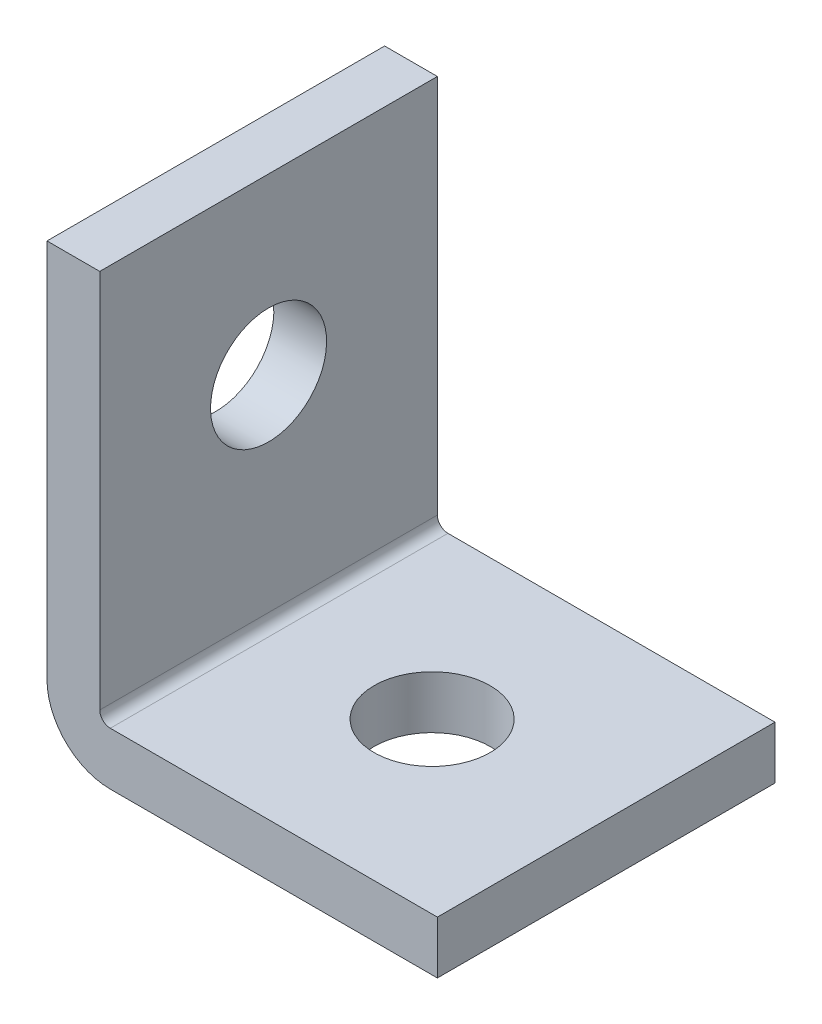
ISO-10303-21;
HEADER;
FILE_DESCRIPTION(('STEP AP214'),'2;1');
FILE_NAME('part.step','',(''),(''),'','','');
FILE_SCHEMA(('AUTOMOTIVE_DESIGN { 1 0 10303 214 1 1 1 1 }'));
ENDSEC;
DATA;
#1=APPLICATION_CONTEXT('core data for automotive mechanical design processes');
#2=APPLICATION_PROTOCOL_DEFINITION('international standard','automotive_design',2000,#1);
#3=PRODUCT_CONTEXT('',#1,'mechanical');
#4=PRODUCT('Part','Part','',(#3));
#5=PRODUCT_RELATED_PRODUCT_CATEGORY('part','',(#4));
#6=PRODUCT_DEFINITION_FORMATION('','',#4);
#7=PRODUCT_DEFINITION_CONTEXT('part definition',#1,'design');
#8=PRODUCT_DEFINITION('design','',#6,#7);
#9=PRODUCT_DEFINITION_SHAPE('','',#8);
#10=(LENGTH_UNIT() NAMED_UNIT(*) SI_UNIT(.MILLI.,.METRE.));
#11=(NAMED_UNIT(*) PLANE_ANGLE_UNIT() SI_UNIT($,.RADIAN.));
#12=(NAMED_UNIT(*) SI_UNIT($,.STERADIAN.) SOLID_ANGLE_UNIT());
#13=UNCERTAINTY_MEASURE_WITH_UNIT(LENGTH_MEASURE(1.E-05),#10,'distance_accuracy_value','');
#14=(GEOMETRIC_REPRESENTATION_CONTEXT(3) GLOBAL_UNCERTAINTY_ASSIGNED_CONTEXT((#13)) GLOBAL_UNIT_ASSIGNED_CONTEXT((#10,
#11,#12)) REPRESENTATION_CONTEXT('',''));
#15=CARTESIAN_POINT('',(0.,0.,0.));
#16=DIRECTION('',(0.,0.,1.));
#17=DIRECTION('',(1.,0.,0.));
#18=AXIS2_PLACEMENT_3D('',#15,#16,#17);
#19=CARTESIAN_POINT('',(0.,46.99,20.32));
#20=DIRECTION('',(0.,-1.,0.));
#21=DIRECTION('',(0.,0.,-1.));
#22=AXIS2_PLACEMENT_3D('',#19,#20,#21);
#23=PLANE('',#22);
#24=DIRECTION('',(-1.,0.,0.));
#25=VECTOR('',#24,1.);
#26=CARTESIAN_POINT('',(0.,46.99,-20.32));
#27=LINE('',#26,#25);
#28=CARTESIAN_POINT('',(0.,46.99,-20.32));
#29=VERTEX_POINT('',#28);
#30=CARTESIAN_POINT('',(-6.35000000000001,46.99,-20.32));
#31=VERTEX_POINT('',#30);
#32=EDGE_CURVE('E128',#29,#31,#27,.T.);
#33=ORIENTED_EDGE('',*,*,#32,.T.);
#34=DIRECTION('',(0.,0.,-1.));
#35=VECTOR('',#34,1.);
#36=CARTESIAN_POINT('',(-6.35000000000001,46.99,20.32));
#37=LINE('',#36,#35);
#38=CARTESIAN_POINT('',(-6.35000000000001,46.99,20.32));
#39=VERTEX_POINT('',#38);
#40=EDGE_CURVE('E11',#39,#31,#37,.T.);
#41=ORIENTED_EDGE('',*,*,#40,.F.);
#42=DIRECTION('',(-1.,0.,0.));
#43=VECTOR('',#42,1.);
#44=CARTESIAN_POINT('',(0.,46.99,20.32));
#45=LINE('',#44,#43);
#46=CARTESIAN_POINT('',(0.,46.99,20.32));
#47=VERTEX_POINT('',#46);
#48=EDGE_CURVE('E143',#47,#39,#45,.T.);
#49=ORIENTED_EDGE('',*,*,#48,.F.);
#50=DIRECTION('',(0.,0.,-1.));
#51=VECTOR('',#50,1.);
#52=CARTESIAN_POINT('',(0.,46.99,20.32));
#53=LINE('',#52,#51);
#54=EDGE_CURVE('E124',#47,#29,#53,.T.);
#55=ORIENTED_EDGE('',*,*,#54,.T.);
#56=EDGE_LOOP('',(#33,#41,#49,#55));
#57=FACE_BOUND('',#56,.T.);
#58=ADVANCED_FACE('F32',(#57),#23,.F.);
#59=CARTESIAN_POINT('',(-6.35000000000001,46.99,20.32));
#60=DIRECTION('',(1.,0.,0.));
#61=DIRECTION('',(0.,1.,0.));
#62=AXIS2_PLACEMENT_3D('',#59,#60,#61);
#63=PLANE('',#62);
#64=CARTESIAN_POINT('',(-6.35,26.035,0.));
#65=DIRECTION('',(1.,0.,0.));
#66=DIRECTION('',(0.,1.,0.));
#67=AXIS2_PLACEMENT_3D('',#64,#65,#66);
#68=CIRCLE('',#67,6.985);
#69=CARTESIAN_POINT('',(-6.35,33.02,0.));
#70=VERTEX_POINT('',#69);
#71=EDGE_CURVE('E132',#70,#70,#68,.F.);
#72=ORIENTED_EDGE('',*,*,#71,.F.);
#73=EDGE_LOOP('',(#72));
#74=FACE_BOUND('',#73,.T.);
#75=DIRECTION('',(0.,-1.,0.));
#76=VECTOR('',#75,1.);
#77=CARTESIAN_POINT('',(-6.35000000000001,46.99,-20.32));
#78=LINE('',#77,#76);
#79=CARTESIAN_POINT('',(-6.35,1.27000000000005,-20.32));
#80=VERTEX_POINT('',#79);
#81=EDGE_CURVE('E131',#31,#80,#78,.T.);
#82=ORIENTED_EDGE('',*,*,#81,.T.);
#83=DIRECTION('',(0.,0.,-1.));
#84=VECTOR('',#83,1.);
#85=CARTESIAN_POINT('',(-6.35,1.27000000000005,20.32));
#86=LINE('',#85,#84);
#87=CARTESIAN_POINT('',(-6.35,1.27000000000005,20.32));
#88=VERTEX_POINT('',#87);
#89=EDGE_CURVE('E40',#88,#80,#86,.T.);
#90=ORIENTED_EDGE('',*,*,#89,.F.);
#91=DIRECTION('',(0.,-1.,0.));
#92=VECTOR('',#91,1.);
#93=CARTESIAN_POINT('',(-6.35000000000001,46.99,20.32));
#94=LINE('',#93,#92);
#95=EDGE_CURVE('E91',#39,#88,#94,.T.);
#96=ORIENTED_EDGE('',*,*,#95,.F.);
#97=ORIENTED_EDGE('',*,*,#40,.T.);
#98=EDGE_LOOP('',(#82,#90,#96,#97));
#99=FACE_BOUND('',#98,.T.);
#100=ADVANCED_FACE('F201',(#74,#99),#63,.F.);
#101=CARTESIAN_POINT('',(1.27,1.27,20.32));
#102=DIRECTION('',(0.,0.,-1.));
#103=DIRECTION('',(-1.,0.,0.));
#104=AXIS2_PLACEMENT_3D('',#101,#102,#103);
#105=CYLINDRICAL_SURFACE('',#104,7.62);
#106=CARTESIAN_POINT('',(1.27,1.27,-20.32));
#107=DIRECTION('',(0.,0.,1.));
#108=DIRECTION('',(1.,0.,0.));
#109=AXIS2_PLACEMENT_3D('',#106,#107,#108);
#110=CIRCLE('',#109,7.62);
#111=CARTESIAN_POINT('',(1.27000000000006,-6.35,-20.32));
#112=VERTEX_POINT('',#111);
#113=EDGE_CURVE('E134',#80,#112,#110,.T.);
#114=ORIENTED_EDGE('',*,*,#113,.T.);
#115=DIRECTION('',(0.,0.,-1.));
#116=VECTOR('',#115,1.);
#117=CARTESIAN_POINT('',(1.27000000000006,-6.35,20.32));
#118=LINE('',#117,#116);
#119=CARTESIAN_POINT('',(1.27000000000006,-6.35,20.32));
#120=VERTEX_POINT('',#119);
#121=EDGE_CURVE('E150',#120,#112,#118,.T.);
#122=ORIENTED_EDGE('',*,*,#121,.F.);
#123=CARTESIAN_POINT('',(1.27,1.27,20.32));
#124=DIRECTION('',(0.,0.,1.));
#125=DIRECTION('',(1.,0.,0.));
#126=AXIS2_PLACEMENT_3D('',#123,#124,#125);
#127=CIRCLE('',#126,7.62);
#128=EDGE_CURVE('E158',#88,#120,#127,.T.);
#129=ORIENTED_EDGE('',*,*,#128,.F.);
#130=ORIENTED_EDGE('',*,*,#89,.T.);
#131=EDGE_LOOP('',(#114,#122,#129,#130));
#132=FACE_BOUND('',#131,.T.);
#133=ADVANCED_FACE('F156',(#132),#105,.T.);
#134=CARTESIAN_POINT('',(1.27000000000006,-6.35,20.32));
#135=DIRECTION('',(0.,1.,0.));
#136=DIRECTION('',(-1.,0.,0.));
#137=AXIS2_PLACEMENT_3D('',#134,#135,#136);
#138=PLANE('',#137);
#139=CARTESIAN_POINT('',(19.685,-6.34999999999999,0.));
#140=DIRECTION('',(0.,1.,0.));
#141=DIRECTION('',(-1.,0.,0.));
#142=AXIS2_PLACEMENT_3D('',#139,#140,#141);
#143=CIRCLE('',#142,6.985);
#144=CARTESIAN_POINT('',(12.7,-6.35,0.));
#145=VERTEX_POINT('',#144);
#146=EDGE_CURVE('E181',#145,#145,#143,.F.);
#147=ORIENTED_EDGE('',*,*,#146,.F.);
#148=EDGE_LOOP('',(#147));
#149=FACE_BOUND('',#148,.T.);
#150=DIRECTION('',(1.,0.,0.));
#151=VECTOR('',#150,1.);
#152=CARTESIAN_POINT('',(1.27000000000006,-6.35,-20.32));
#153=LINE('',#152,#151);
#154=CARTESIAN_POINT('',(40.64,-6.34999999999999,-20.32));
#155=VERTEX_POINT('',#154);
#156=EDGE_CURVE('E136',#112,#155,#153,.T.);
#157=ORIENTED_EDGE('',*,*,#156,.T.);
#158=DIRECTION('',(0.,0.,-1.));
#159=VECTOR('',#158,1.);
#160=CARTESIAN_POINT('',(40.64,-6.34999999999999,20.32));
#161=LINE('',#160,#159);
#162=CARTESIAN_POINT('',(40.64,-6.34999999999999,20.32));
#163=VERTEX_POINT('',#162);
#164=EDGE_CURVE('E147',#163,#155,#161,.T.);
#165=ORIENTED_EDGE('',*,*,#164,.F.);
#166=DIRECTION('',(1.,0.,0.));
#167=VECTOR('',#166,1.);
#168=CARTESIAN_POINT('',(1.27000000000006,-6.35,20.32));
#169=LINE('',#168,#167);
#170=EDGE_CURVE('E170',#120,#163,#169,.T.);
#171=ORIENTED_EDGE('',*,*,#170,.F.);
#172=ORIENTED_EDGE('',*,*,#121,.T.);
#173=EDGE_LOOP('',(#157,#165,#171,#172));
#174=FACE_BOUND('',#173,.T.);
#175=ADVANCED_FACE('F166',(#149,#174),#138,.F.);
#176=CARTESIAN_POINT('',(40.64,-6.34999999999999,20.32));
#177=DIRECTION('',(-1.,0.,0.));
#178=DIRECTION('',(0.,0.,1.));
#179=AXIS2_PLACEMENT_3D('',#176,#177,#178);
#180=PLANE('',#179);
#181=DIRECTION('',(0.,1.,0.));
#182=VECTOR('',#181,1.);
#183=CARTESIAN_POINT('',(40.64,-6.34999999999999,-20.32));
#184=LINE('',#183,#182);
#185=CARTESIAN_POINT('',(40.64,0.,-20.32));
#186=VERTEX_POINT('',#185);
#187=EDGE_CURVE('E138',#155,#186,#184,.T.);
#188=ORIENTED_EDGE('',*,*,#187,.T.);
#189=DIRECTION('',(0.,0.,-1.));
#190=VECTOR('',#189,1.);
#191=CARTESIAN_POINT('',(40.64,0.,20.32));
#192=LINE('',#191,#190);
#193=CARTESIAN_POINT('',(40.64,0.,20.32));
#194=VERTEX_POINT('',#193);
#195=EDGE_CURVE('E119',#194,#186,#192,.T.);
#196=ORIENTED_EDGE('',*,*,#195,.F.);
#197=DIRECTION('',(0.,1.,0.));
#198=VECTOR('',#197,1.);
#199=CARTESIAN_POINT('',(40.64,-6.34999999999999,20.32));
#200=LINE('',#199,#198);
#201=EDGE_CURVE('E110',#163,#194,#200,.T.);
#202=ORIENTED_EDGE('',*,*,#201,.F.);
#203=ORIENTED_EDGE('',*,*,#164,.T.);
#204=EDGE_LOOP('',(#188,#196,#202,#203));
#205=FACE_BOUND('',#204,.T.);
#206=ADVANCED_FACE('F169',(#205),#180,.F.);
#207=CARTESIAN_POINT('',(40.64,0.,20.32));
#208=DIRECTION('',(0.,-1.,0.));
#209=DIRECTION('',(1.,0.,0.));
#210=AXIS2_PLACEMENT_3D('',#207,#208,#209);
#211=PLANE('',#210);
#212=CARTESIAN_POINT('',(19.685,0.,0.));
#213=DIRECTION('',(0.,1.,0.));
#214=DIRECTION('',(-1.,0.,0.));
#215=AXIS2_PLACEMENT_3D('',#212,#213,#214);
#216=CIRCLE('',#215,6.985);
#217=CARTESIAN_POINT('',(12.7,0.,0.));
#218=VERTEX_POINT('',#217);
#219=EDGE_CURVE('E184',#218,#218,#216,.T.);
#220=ORIENTED_EDGE('',*,*,#219,.F.);
#221=EDGE_LOOP('',(#220));
#222=FACE_BOUND('',#221,.T.);
#223=DIRECTION('',(-1.,0.,0.));
#224=VECTOR('',#223,1.);
#225=CARTESIAN_POINT('',(40.64,0.,-20.32));
#226=LINE('',#225,#224);
#227=CARTESIAN_POINT('',(1.27000000000001,0.,-20.32));
#228=VERTEX_POINT('',#227);
#229=EDGE_CURVE('E118',#186,#228,#226,.T.);
#230=ORIENTED_EDGE('',*,*,#229,.T.);
#231=DIRECTION('',(0.,0.,-1.));
#232=VECTOR('',#231,1.);
#233=CARTESIAN_POINT('',(1.27000000000001,0.,20.32));
#234=LINE('',#233,#232);
#235=CARTESIAN_POINT('',(1.27000000000001,0.,20.32));
#236=VERTEX_POINT('',#235);
#237=EDGE_CURVE('E115',#236,#228,#234,.T.);
#238=ORIENTED_EDGE('',*,*,#237,.F.);
#239=DIRECTION('',(-1.,0.,0.));
#240=VECTOR('',#239,1.);
#241=CARTESIAN_POINT('',(40.64,0.,20.32));
#242=LINE('',#241,#240);
#243=EDGE_CURVE('E104',#194,#236,#242,.T.);
#244=ORIENTED_EDGE('',*,*,#243,.F.);
#245=ORIENTED_EDGE('',*,*,#195,.T.);
#246=EDGE_LOOP('',(#230,#238,#244,#245));
#247=FACE_BOUND('',#246,.T.);
#248=ADVANCED_FACE('F116',(#222,#247),#211,.F.);
#249=CARTESIAN_POINT('',(1.27,1.27,20.32));
#250=DIRECTION('',(0.,0.,-1.));
#251=DIRECTION('',(-1.,0.,0.));
#252=AXIS2_PLACEMENT_3D('',#249,#250,#251);
#253=CYLINDRICAL_SURFACE('',#252,1.27);
#254=CARTESIAN_POINT('',(1.27,1.27,-20.32));
#255=DIRECTION('',(0.,0.,-1.));
#256=DIRECTION('',(1.,0.,0.));
#257=AXIS2_PLACEMENT_3D('',#254,#255,#256);
#258=CIRCLE('',#257,1.27);
#259=CARTESIAN_POINT('',(0.,1.27000000000001,-20.32));
#260=VERTEX_POINT('',#259);
#261=EDGE_CURVE('E77',#228,#260,#258,.T.);
#262=ORIENTED_EDGE('',*,*,#261,.T.);
#263=DIRECTION('',(0.,0.,-1.));
#264=VECTOR('',#263,1.);
#265=CARTESIAN_POINT('',(0.,1.27000000000001,20.32));
#266=LINE('',#265,#264);
#267=CARTESIAN_POINT('',(0.,1.27000000000001,20.32));
#268=VERTEX_POINT('',#267);
#269=EDGE_CURVE('E120',#268,#260,#266,.T.);
#270=ORIENTED_EDGE('',*,*,#269,.F.);
#271=CARTESIAN_POINT('',(1.27,1.27,20.32));
#272=DIRECTION('',(0.,0.,-1.));
#273=DIRECTION('',(1.,0.,0.));
#274=AXIS2_PLACEMENT_3D('',#271,#272,#273);
#275=CIRCLE('',#274,1.27);
#276=EDGE_CURVE('E108',#236,#268,#275,.T.);
#277=ORIENTED_EDGE('',*,*,#276,.F.);
#278=ORIENTED_EDGE('',*,*,#237,.T.);
#279=EDGE_LOOP('',(#262,#270,#277,#278));
#280=FACE_BOUND('',#279,.T.);
#281=ADVANCED_FACE('F122',(#280),#253,.F.);
#282=CARTESIAN_POINT('',(0.,1.27000000000001,20.32));
#283=DIRECTION('',(-1.,0.,0.));
#284=DIRECTION('',(0.,-1.,0.));
#285=AXIS2_PLACEMENT_3D('',#282,#283,#284);
#286=PLANE('',#285);
#287=CARTESIAN_POINT('',(0.,26.035,0.));
#288=DIRECTION('',(1.,0.,0.));
#289=DIRECTION('',(0.,1.,0.));
#290=AXIS2_PLACEMENT_3D('',#287,#288,#289);
#291=CIRCLE('',#290,6.985);
#292=CARTESIAN_POINT('',(0.,33.02,0.));
#293=VERTEX_POINT('',#292);
#294=EDGE_CURVE('E178',#293,#293,#291,.T.);
#295=ORIENTED_EDGE('',*,*,#294,.F.);
#296=EDGE_LOOP('',(#295));
#297=FACE_BOUND('',#296,.T.);
#298=DIRECTION('',(0.,1.,0.));
#299=VECTOR('',#298,1.);
#300=CARTESIAN_POINT('',(0.,1.27000000000001,-20.32));
#301=LINE('',#300,#299);
#302=EDGE_CURVE('E83',#260,#29,#301,.T.);
#303=ORIENTED_EDGE('',*,*,#302,.T.);
#304=ORIENTED_EDGE('',*,*,#54,.F.);
#305=DIRECTION('',(0.,1.,0.));
#306=VECTOR('',#305,1.);
#307=CARTESIAN_POINT('',(0.,1.27000000000001,20.32));
#308=LINE('',#307,#306);
#309=EDGE_CURVE('E48',#268,#47,#308,.T.);
#310=ORIENTED_EDGE('',*,*,#309,.F.);
#311=ORIENTED_EDGE('',*,*,#269,.T.);
#312=EDGE_LOOP('',(#303,#304,#310,#311));
#313=FACE_BOUND('',#312,.T.);
#314=ADVANCED_FACE('F197',(#297,#313),#286,.F.);
#315=CARTESIAN_POINT('',(1.27,1.27,20.32));
#316=DIRECTION('',(0.,0.,1.));
#317=DIRECTION('',(1.,0.,0.));
#318=AXIS2_PLACEMENT_3D('',#315,#316,#317);
#319=PLANE('',#318);
#320=ORIENTED_EDGE('',*,*,#48,.T.);
#321=ORIENTED_EDGE('',*,*,#95,.T.);
#322=ORIENTED_EDGE('',*,*,#128,.T.);
#323=ORIENTED_EDGE('',*,*,#170,.T.);
#324=ORIENTED_EDGE('',*,*,#201,.T.);
#325=ORIENTED_EDGE('',*,*,#243,.T.);
#326=ORIENTED_EDGE('',*,*,#276,.T.);
#327=ORIENTED_EDGE('',*,*,#309,.T.);
#328=EDGE_LOOP('',(#320,#321,#322,#323,#324,#325,#326,#327));
#329=FACE_BOUND('',#328,.T.);
#330=ADVANCED_FACE('F106',(#329),#319,.T.);
#331=CARTESIAN_POINT('',(1.27,1.27,-20.32));
#332=DIRECTION('',(0.,0.,1.));
#333=DIRECTION('',(1.,0.,0.));
#334=AXIS2_PLACEMENT_3D('',#331,#332,#333);
#335=PLANE('',#334);
#336=ORIENTED_EDGE('',*,*,#32,.F.);
#337=ORIENTED_EDGE('',*,*,#302,.F.);
#338=ORIENTED_EDGE('',*,*,#261,.F.);
#339=ORIENTED_EDGE('',*,*,#229,.F.);
#340=ORIENTED_EDGE('',*,*,#187,.F.);
#341=ORIENTED_EDGE('',*,*,#156,.F.);
#342=ORIENTED_EDGE('',*,*,#113,.F.);
#343=ORIENTED_EDGE('',*,*,#81,.F.);
#344=EDGE_LOOP('',(#336,#337,#338,#339,#340,#341,#342,#343));
#345=FACE_BOUND('',#344,.T.);
#346=ADVANCED_FACE('F162',(#345),#335,.F.);
#347=CARTESIAN_POINT('',(-6.35100000000001,26.035,0.));
#348=DIRECTION('',(1.,0.,0.));
#349=DIRECTION('',(0.,1.,0.));
#350=AXIS2_PLACEMENT_3D('',#347,#348,#349);
#351=CYLINDRICAL_SURFACE('',#350,6.985);
#352=ORIENTED_EDGE('',*,*,#294,.T.);
#353=EDGE_LOOP('',(#352));
#354=FACE_BOUND('',#353,.T.);
#355=ORIENTED_EDGE('',*,*,#71,.T.);
#356=EDGE_LOOP('',(#355));
#357=FACE_BOUND('',#356,.T.);
#358=ADVANCED_FACE('F219',(#354,#357),#351,.F.);
#359=CARTESIAN_POINT('',(19.685,-6.351,0.));
#360=DIRECTION('',(0.,1.,0.));
#361=DIRECTION('',(-1.,0.,0.));
#362=AXIS2_PLACEMENT_3D('',#359,#360,#361);
#363=CYLINDRICAL_SURFACE('',#362,6.985);
#364=ORIENTED_EDGE('',*,*,#219,.T.);
#365=EDGE_LOOP('',(#364));
#366=FACE_BOUND('',#365,.T.);
#367=ORIENTED_EDGE('',*,*,#146,.T.);
#368=EDGE_LOOP('',(#367));
#369=FACE_BOUND('',#368,.T.);
#370=ADVANCED_FACE('F188',(#366,#369),#363,.F.);
#371=CLOSED_SHELL('',(#58,#100,#133,#175,#206,#248,#281,#314,#330,#346,#358,#370));
#372=MANIFOLD_SOLID_BREP('B2',#371);
#373=ADVANCED_BREP_SHAPE_REPRESENTATION('',(#18,#372),#14);
#374=SHAPE_DEFINITION_REPRESENTATION(#9,#373);
ENDSEC;
END-ISO-10303-21;
